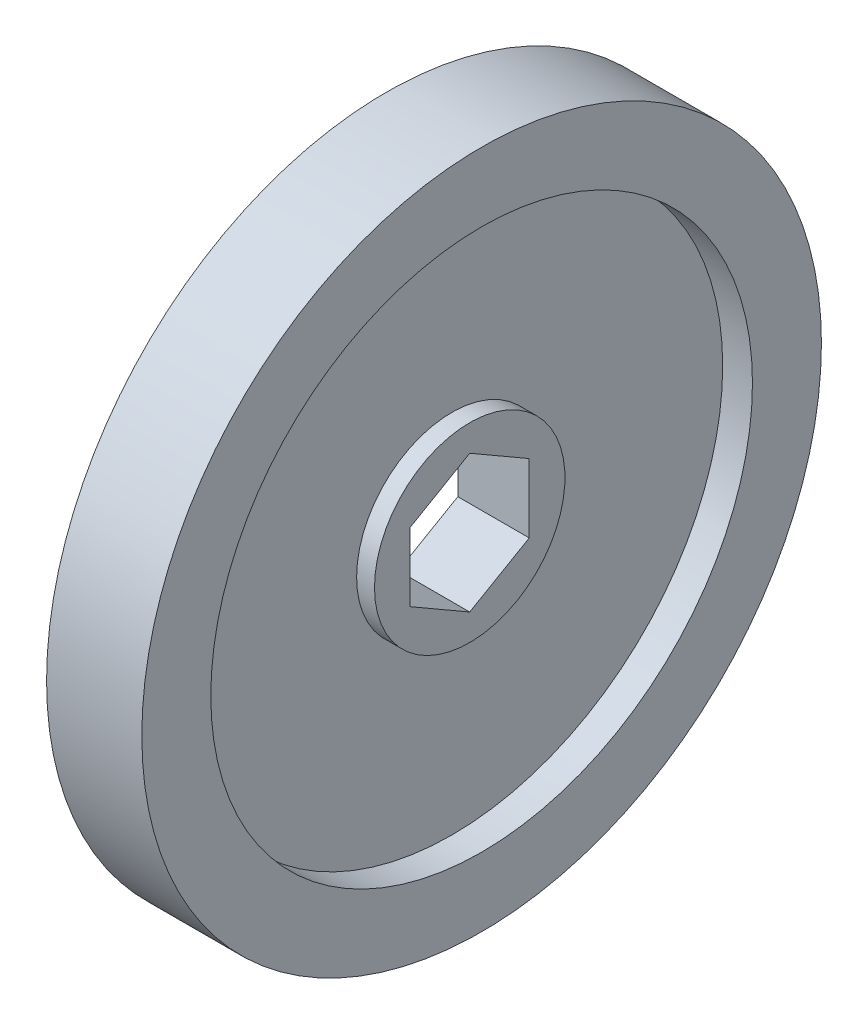
ISO-10303-21;
HEADER;
FILE_DESCRIPTION(('STEP AP214'),'2;1');
FILE_NAME('part.step','',(''),(''),'','','');
FILE_SCHEMA(('AUTOMOTIVE_DESIGN { 1 0 10303 214 1 1 1 1 }'));
ENDSEC;
DATA;
#1=APPLICATION_CONTEXT('core data for automotive mechanical design processes');
#2=APPLICATION_PROTOCOL_DEFINITION('international standard','automotive_design',2000,#1);
#3=PRODUCT_CONTEXT('',#1,'mechanical');
#4=PRODUCT('Part','Part','',(#3));
#5=PRODUCT_RELATED_PRODUCT_CATEGORY('part','',(#4));
#6=PRODUCT_DEFINITION_FORMATION('','',#4);
#7=PRODUCT_DEFINITION_CONTEXT('part definition',#1,'design');
#8=PRODUCT_DEFINITION('design','',#6,#7);
#9=PRODUCT_DEFINITION_SHAPE('','',#8);
#10=(LENGTH_UNIT() NAMED_UNIT(*) SI_UNIT(.MILLI.,.METRE.));
#11=(NAMED_UNIT(*) PLANE_ANGLE_UNIT() SI_UNIT($,.RADIAN.));
#12=(NAMED_UNIT(*) SI_UNIT($,.STERADIAN.) SOLID_ANGLE_UNIT());
#13=UNCERTAINTY_MEASURE_WITH_UNIT(LENGTH_MEASURE(1.E-05),#10,'distance_accuracy_value','');
#14=(GEOMETRIC_REPRESENTATION_CONTEXT(3) GLOBAL_UNCERTAINTY_ASSIGNED_CONTEXT((#13)) GLOBAL_UNIT_ASSIGNED_CONTEXT((#10,
#11,#12)) REPRESENTATION_CONTEXT('',''));
#15=CARTESIAN_POINT('',(0.,0.,0.));
#16=DIRECTION('',(0.,0.,1.));
#17=DIRECTION('',(1.,0.,0.));
#18=AXIS2_PLACEMENT_3D('',#15,#16,#17);
#19=CARTESIAN_POINT('',(5.08,36.25,0.));
#20=DIRECTION('',(-1.,0.,0.));
#21=DIRECTION('',(0.,0.,1.));
#22=AXIS2_PLACEMENT_3D('',#19,#20,#21);
#23=PLANE('',#22);
#24=CARTESIAN_POINT('',(5.08,0.,0.));
#25=DIRECTION('',(-1.,0.,0.));
#26=DIRECTION('',(0.,0.,1.));
#27=AXIS2_PLACEMENT_3D('',#24,#25,#26);
#28=CIRCLE('',#27,36.25);
#29=CARTESIAN_POINT('',(5.08,0.,36.25));
#30=VERTEX_POINT('',#29);
#31=EDGE_CURVE('E129',#30,#30,#28,.T.);
#32=ORIENTED_EDGE('',*,*,#31,.F.);
#33=EDGE_LOOP('',(#32));
#34=FACE_BOUND('',#33,.T.);
#35=CARTESIAN_POINT('',(5.08,0.,0.));
#36=DIRECTION('',(-1.,0.,0.));
#37=DIRECTION('',(0.,0.,1.));
#38=AXIS2_PLACEMENT_3D('',#35,#36,#37);
#39=CIRCLE('',#38,28.8925);
#40=CARTESIAN_POINT('',(5.08,0.,28.8925));
#41=VERTEX_POINT('',#40);
#42=EDGE_CURVE('E162',#41,#41,#39,.T.);
#43=ORIENTED_EDGE('',*,*,#42,.T.);
#44=EDGE_LOOP('',(#43));
#45=FACE_BOUND('',#44,.T.);
#46=ADVANCED_FACE('F44',(#34,#45),#23,.F.);
#47=CARTESIAN_POINT('',(-12.5660346603092,0.,0.));
#48=DIRECTION('',(-1.,0.,0.));
#49=DIRECTION('',(0.,0.,1.));
#50=AXIS2_PLACEMENT_3D('',#47,#48,#49);
#51=CYLINDRICAL_SURFACE('',#50,28.8925);
#52=ORIENTED_EDGE('',*,*,#42,.F.);
#53=EDGE_LOOP('',(#52));
#54=FACE_BOUND('',#53,.T.);
#55=CARTESIAN_POINT('',(1.905,0.,0.));
#56=DIRECTION('',(-1.,0.,0.));
#57=DIRECTION('',(0.,0.,1.));
#58=AXIS2_PLACEMENT_3D('',#55,#56,#57);
#59=CIRCLE('',#58,28.8925);
#60=CARTESIAN_POINT('',(1.905,0.,28.8925));
#61=VERTEX_POINT('',#60);
#62=EDGE_CURVE('E159',#61,#61,#59,.T.);
#63=ORIENTED_EDGE('',*,*,#62,.T.);
#64=EDGE_LOOP('',(#63));
#65=FACE_BOUND('',#64,.T.);
#66=ADVANCED_FACE('F201',(#54,#65),#51,.F.);
#67=CARTESIAN_POINT('',(1.905,28.8925,0.));
#68=DIRECTION('',(-1.,0.,0.));
#69=DIRECTION('',(0.,0.,1.));
#70=AXIS2_PLACEMENT_3D('',#67,#68,#69);
#71=PLANE('',#70);
#72=ORIENTED_EDGE('',*,*,#62,.F.);
#73=EDGE_LOOP('',(#72));
#74=FACE_BOUND('',#73,.T.);
#75=CARTESIAN_POINT('',(1.905,0.,0.));
#76=DIRECTION('',(-1.,0.,0.));
#77=DIRECTION('',(0.,0.,1.));
#78=AXIS2_PLACEMENT_3D('',#75,#76,#77);
#79=CIRCLE('',#78,10.16);
#80=CARTESIAN_POINT('',(1.905,0.,10.16));
#81=VERTEX_POINT('',#80);
#82=EDGE_CURVE('E156',#81,#81,#79,.T.);
#83=ORIENTED_EDGE('',*,*,#82,.T.);
#84=EDGE_LOOP('',(#83));
#85=FACE_BOUND('',#84,.T.);
#86=ADVANCED_FACE('F206',(#74,#85),#71,.F.);
#87=CARTESIAN_POINT('',(-12.5660346603092,0.,0.));
#88=DIRECTION('',(-1.,0.,0.));
#89=DIRECTION('',(0.,0.,1.));
#90=AXIS2_PLACEMENT_3D('',#87,#88,#89);
#91=CYLINDRICAL_SURFACE('',#90,10.16);
#92=ORIENTED_EDGE('',*,*,#82,.F.);
#93=EDGE_LOOP('',(#92));
#94=FACE_BOUND('',#93,.T.);
#95=CARTESIAN_POINT('',(3.81,0.,0.));
#96=DIRECTION('',(-1.,0.,0.));
#97=DIRECTION('',(0.,0.,1.));
#98=AXIS2_PLACEMENT_3D('',#95,#96,#97);
#99=CIRCLE('',#98,10.16);
#100=CARTESIAN_POINT('',(3.81,0.,10.16));
#101=VERTEX_POINT('',#100);
#102=EDGE_CURVE('E153',#101,#101,#99,.T.);
#103=ORIENTED_EDGE('',*,*,#102,.T.);
#104=EDGE_LOOP('',(#103));
#105=FACE_BOUND('',#104,.T.);
#106=ADVANCED_FACE('F216',(#94,#105),#91,.T.);
#107=CARTESIAN_POINT('',(3.81,10.16,0.));
#108=DIRECTION('',(-1.,0.,0.));
#109=DIRECTION('',(0.,0.,1.));
#110=AXIS2_PLACEMENT_3D('',#107,#108,#109);
#111=PLANE('',#110);
#112=DIRECTION('',(0.,-0.5,0.866025403784439));
#113=VECTOR('',#112,1.);
#114=CARTESIAN_POINT('',(3.81,7.33234841870825,0.));
#115=LINE('',#114,#113);
#116=CARTESIAN_POINT('',(3.81,7.33234841870825,0.));
#117=VERTEX_POINT('',#116);
#118=CARTESIAN_POINT('',(3.81,3.66617420935413,6.35));
#119=VERTEX_POINT('',#118);
#120=EDGE_CURVE('E108',#117,#119,#115,.T.);
#121=ORIENTED_EDGE('',*,*,#120,.F.);
#122=DIRECTION('',(0.,0.5,0.866025403784439));
#123=VECTOR('',#122,1.);
#124=CARTESIAN_POINT('',(3.81,3.66617420935412,-6.35));
#125=LINE('',#124,#123);
#126=CARTESIAN_POINT('',(3.81,3.66617420935412,-6.35));
#127=VERTEX_POINT('',#126);
#128=EDGE_CURVE('E58',#127,#117,#125,.T.);
#129=ORIENTED_EDGE('',*,*,#128,.F.);
#130=DIRECTION('',(0.,1.,0.));
#131=VECTOR('',#130,1.);
#132=CARTESIAN_POINT('',(3.81,-3.66617420935413,-6.35));
#133=LINE('',#132,#131);
#134=CARTESIAN_POINT('',(3.81,-3.66617420935413,-6.35));
#135=VERTEX_POINT('',#134);
#136=EDGE_CURVE('E124',#135,#127,#133,.T.);
#137=ORIENTED_EDGE('',*,*,#136,.F.);
#138=DIRECTION('',(0.,0.5,-0.866025403784439));
#139=VECTOR('',#138,1.);
#140=CARTESIAN_POINT('',(3.81,-7.33234841870825,0.));
#141=LINE('',#140,#139);
#142=CARTESIAN_POINT('',(3.81,-7.33234841870825,0.));
#143=VERTEX_POINT('',#142);
#144=EDGE_CURVE('E118',#143,#135,#141,.T.);
#145=ORIENTED_EDGE('',*,*,#144,.F.);
#146=DIRECTION('',(0.,-0.5,-0.866025403784439));
#147=VECTOR('',#146,1.);
#148=CARTESIAN_POINT('',(3.81,-3.66617420935413,6.35));
#149=LINE('',#148,#147);
#150=CARTESIAN_POINT('',(3.81,-3.66617420935413,6.35));
#151=VERTEX_POINT('',#150);
#152=EDGE_CURVE('E116',#151,#143,#149,.T.);
#153=ORIENTED_EDGE('',*,*,#152,.F.);
#154=DIRECTION('',(0.,-1.,0.));
#155=VECTOR('',#154,1.);
#156=CARTESIAN_POINT('',(3.81,3.66617420935413,6.35));
#157=LINE('',#156,#155);
#158=EDGE_CURVE('E99',#119,#151,#157,.T.);
#159=ORIENTED_EDGE('',*,*,#158,.F.);
#160=EDGE_LOOP('',(#121,#129,#137,#145,#153,#159));
#161=FACE_BOUND('',#160,.T.);
#162=ORIENTED_EDGE('',*,*,#102,.F.);
#163=EDGE_LOOP('',(#162));
#164=FACE_BOUND('',#163,.T.);
#165=ADVANCED_FACE('F112',(#161,#164),#111,.F.);
#166=CARTESIAN_POINT('',(-3.81,10.16,0.));
#167=DIRECTION('',(1.,0.,0.));
#168=DIRECTION('',(0.,0.,-1.));
#169=AXIS2_PLACEMENT_3D('',#166,#167,#168);
#170=PLANE('',#169);
#171=DIRECTION('',(0.,1.,0.));
#172=VECTOR('',#171,1.);
#173=CARTESIAN_POINT('',(-3.81,10.16,-6.35));
#174=LINE('',#173,#172);
#175=CARTESIAN_POINT('',(-3.81,-3.66617420935413,-6.35));
#176=VERTEX_POINT('',#175);
#177=CARTESIAN_POINT('',(-3.81,3.66617420935412,-6.35));
#178=VERTEX_POINT('',#177);
#179=EDGE_CURVE('E51',#176,#178,#174,.T.);
#180=ORIENTED_EDGE('',*,*,#179,.T.);
#181=DIRECTION('',(0.,0.5,0.866025403784439));
#182=VECTOR('',#181,1.);
#183=CARTESIAN_POINT('',(-3.81,8.03926131403118,1.22440905122495));
#184=LINE('',#183,#182);
#185=CARTESIAN_POINT('',(-3.81,7.33234841870825,0.));
#186=VERTEX_POINT('',#185);
#187=EDGE_CURVE('E13',#178,#186,#184,.T.);
#188=ORIENTED_EDGE('',*,*,#187,.T.);
#189=DIRECTION('',(0.,-0.5,0.866025403784439));
#190=VECTOR('',#189,1.);
#191=CARTESIAN_POINT('',(-3.81,8.03926131403118,-1.22440905122495));
#192=LINE('',#191,#190);
#193=CARTESIAN_POINT('',(-3.81,3.66617420935413,6.35));
#194=VERTEX_POINT('',#193);
#195=EDGE_CURVE('E165',#186,#194,#192,.T.);
#196=ORIENTED_EDGE('',*,*,#195,.T.);
#197=DIRECTION('',(0.,-1.,0.));
#198=VECTOR('',#197,1.);
#199=CARTESIAN_POINT('',(-3.81,10.16,6.35));
#200=LINE('',#199,#198);
#201=CARTESIAN_POINT('',(-3.81,-3.66617420935413,6.35));
#202=VERTEX_POINT('',#201);
#203=EDGE_CURVE('E102',#194,#202,#200,.T.);
#204=ORIENTED_EDGE('',*,*,#203,.T.);
#205=DIRECTION('',(0.,-0.5,-0.866025403784439));
#206=VECTOR('',#205,1.);
#207=CARTESIAN_POINT('',(-3.81,-2.95926131403119,7.57440905122495));
#208=LINE('',#207,#206);
#209=CARTESIAN_POINT('',(-3.81,-7.33234841870825,0.));
#210=VERTEX_POINT('',#209);
#211=EDGE_CURVE('E168',#202,#210,#208,.T.);
#212=ORIENTED_EDGE('',*,*,#211,.T.);
#213=DIRECTION('',(0.,0.5,-0.866025403784439));
#214=VECTOR('',#213,1.);
#215=CARTESIAN_POINT('',(-3.81,-2.95926131403119,-7.57440905122495));
#216=LINE('',#215,#214);
#217=EDGE_CURVE('E171',#210,#176,#216,.T.);
#218=ORIENTED_EDGE('',*,*,#217,.T.);
#219=EDGE_LOOP('',(#180,#188,#196,#204,#212,#218));
#220=FACE_BOUND('',#219,.T.);
#221=CARTESIAN_POINT('',(-3.81,0.,0.));
#222=DIRECTION('',(-1.,0.,0.));
#223=DIRECTION('',(0.,0.,1.));
#224=AXIS2_PLACEMENT_3D('',#221,#222,#223);
#225=CIRCLE('',#224,10.16);
#226=CARTESIAN_POINT('',(-3.81,0.,10.16));
#227=VERTEX_POINT('',#226);
#228=EDGE_CURVE('E150',#227,#227,#225,.T.);
#229=ORIENTED_EDGE('',*,*,#228,.T.);
#230=EDGE_LOOP('',(#229));
#231=FACE_BOUND('',#230,.T.);
#232=ADVANCED_FACE('F175',(#220,#231),#170,.F.);
#233=CARTESIAN_POINT('',(-12.5660346603092,0.,0.));
#234=DIRECTION('',(-1.,0.,0.));
#235=DIRECTION('',(0.,0.,1.));
#236=AXIS2_PLACEMENT_3D('',#233,#234,#235);
#237=CYLINDRICAL_SURFACE('',#236,10.16);
#238=ORIENTED_EDGE('',*,*,#228,.F.);
#239=EDGE_LOOP('',(#238));
#240=FACE_BOUND('',#239,.T.);
#241=CARTESIAN_POINT('',(-1.905,0.,0.));
#242=DIRECTION('',(-1.,0.,0.));
#243=DIRECTION('',(0.,0.,1.));
#244=AXIS2_PLACEMENT_3D('',#241,#242,#243);
#245=CIRCLE('',#244,10.16);
#246=CARTESIAN_POINT('',(-1.905,0.,10.16));
#247=VERTEX_POINT('',#246);
#248=EDGE_CURVE('E147',#247,#247,#245,.T.);
#249=ORIENTED_EDGE('',*,*,#248,.T.);
#250=EDGE_LOOP('',(#249));
#251=FACE_BOUND('',#250,.T.);
#252=ADVANCED_FACE('F229',(#240,#251),#237,.T.);
#253=CARTESIAN_POINT('',(-1.905,28.8925,0.));
#254=DIRECTION('',(1.,0.,0.));
#255=DIRECTION('',(0.,0.,-1.));
#256=AXIS2_PLACEMENT_3D('',#253,#254,#255);
#257=PLANE('',#256);
#258=ORIENTED_EDGE('',*,*,#248,.F.);
#259=EDGE_LOOP('',(#258));
#260=FACE_BOUND('',#259,.T.);
#261=CARTESIAN_POINT('',(-1.905,0.,0.));
#262=DIRECTION('',(-1.,0.,0.));
#263=DIRECTION('',(0.,0.,1.));
#264=AXIS2_PLACEMENT_3D('',#261,#262,#263);
#265=CIRCLE('',#264,28.8925);
#266=CARTESIAN_POINT('',(-1.905,0.,28.8925));
#267=VERTEX_POINT('',#266);
#268=EDGE_CURVE('E144',#267,#267,#265,.T.);
#269=ORIENTED_EDGE('',*,*,#268,.T.);
#270=EDGE_LOOP('',(#269));
#271=FACE_BOUND('',#270,.T.);
#272=ADVANCED_FACE('F234',(#260,#271),#257,.F.);
#273=CARTESIAN_POINT('',(-12.5660346603092,0.,0.));
#274=DIRECTION('',(-1.,0.,0.));
#275=DIRECTION('',(0.,0.,1.));
#276=AXIS2_PLACEMENT_3D('',#273,#274,#275);
#277=CYLINDRICAL_SURFACE('',#276,28.8925);
#278=ORIENTED_EDGE('',*,*,#268,.F.);
#279=EDGE_LOOP('',(#278));
#280=FACE_BOUND('',#279,.T.);
#281=CARTESIAN_POINT('',(-5.08,0.,0.));
#282=DIRECTION('',(-1.,0.,0.));
#283=DIRECTION('',(0.,0.,1.));
#284=AXIS2_PLACEMENT_3D('',#281,#282,#283);
#285=CIRCLE('',#284,28.8925);
#286=CARTESIAN_POINT('',(-5.08,0.,28.8925));
#287=VERTEX_POINT('',#286);
#288=EDGE_CURVE('E141',#287,#287,#285,.T.);
#289=ORIENTED_EDGE('',*,*,#288,.T.);
#290=EDGE_LOOP('',(#289));
#291=FACE_BOUND('',#290,.T.);
#292=ADVANCED_FACE('F238',(#280,#291),#277,.F.);
#293=CARTESIAN_POINT('',(-5.08,36.25,0.));
#294=DIRECTION('',(1.,0.,0.));
#295=DIRECTION('',(0.,0.,-1.));
#296=AXIS2_PLACEMENT_3D('',#293,#294,#295);
#297=PLANE('',#296);
#298=ORIENTED_EDGE('',*,*,#288,.F.);
#299=EDGE_LOOP('',(#298));
#300=FACE_BOUND('',#299,.T.);
#301=CARTESIAN_POINT('',(-5.08,0.,0.));
#302=DIRECTION('',(-1.,0.,0.));
#303=DIRECTION('',(0.,0.,1.));
#304=AXIS2_PLACEMENT_3D('',#301,#302,#303);
#305=CIRCLE('',#304,36.25);
#306=CARTESIAN_POINT('',(-5.08,0.,36.25));
#307=VERTEX_POINT('',#306);
#308=EDGE_CURVE('E138',#307,#307,#305,.T.);
#309=ORIENTED_EDGE('',*,*,#308,.T.);
#310=EDGE_LOOP('',(#309));
#311=FACE_BOUND('',#310,.T.);
#312=ADVANCED_FACE('F196',(#300,#311),#297,.F.);
#313=CARTESIAN_POINT('',(-12.5660346603092,0.,0.));
#314=DIRECTION('',(-1.,0.,0.));
#315=DIRECTION('',(0.,0.,1.));
#316=AXIS2_PLACEMENT_3D('',#313,#314,#315);
#317=CYLINDRICAL_SURFACE('',#316,36.25);
#318=ORIENTED_EDGE('',*,*,#308,.F.);
#319=EDGE_LOOP('',(#318));
#320=FACE_BOUND('',#319,.T.);
#321=ORIENTED_EDGE('',*,*,#31,.T.);
#322=EDGE_LOOP('',(#321));
#323=FACE_BOUND('',#322,.T.);
#324=ADVANCED_FACE('F189',(#320,#323),#317,.T.);
#325=CARTESIAN_POINT('',(-5.08,3.66617420935412,-6.35));
#326=DIRECTION('',(0.,0.866025403784439,-0.5));
#327=DIRECTION('',(0.,0.5,0.866025403784439));
#328=AXIS2_PLACEMENT_3D('',#325,#326,#327);
#329=PLANE('',#328);
#330=DIRECTION('',(1.,0.,0.));
#331=VECTOR('',#330,1.);
#332=CARTESIAN_POINT('',(-5.08,3.66617420935412,-6.35));
#333=LINE('',#332,#331);
#334=EDGE_CURVE('E127',#178,#127,#333,.T.);
#335=ORIENTED_EDGE('',*,*,#334,.T.);
#336=ORIENTED_EDGE('',*,*,#128,.T.);
#337=DIRECTION('',(1.,0.,0.));
#338=VECTOR('',#337,1.);
#339=CARTESIAN_POINT('',(-5.08,7.33234841870825,0.));
#340=LINE('',#339,#338);
#341=EDGE_CURVE('E105',#186,#117,#340,.T.);
#342=ORIENTED_EDGE('',*,*,#341,.F.);
#343=ORIENTED_EDGE('',*,*,#187,.F.);
#344=EDGE_LOOP('',(#335,#336,#342,#343));
#345=FACE_BOUND('',#344,.T.);
#346=ADVANCED_FACE('F187',(#345),#329,.F.);
#347=CARTESIAN_POINT('',(-5.08,-3.66617420935413,-6.35));
#348=DIRECTION('',(0.,0.,-1.));
#349=DIRECTION('',(0.,1.,0.));
#350=AXIS2_PLACEMENT_3D('',#347,#348,#349);
#351=PLANE('',#350);
#352=DIRECTION('',(1.,0.,0.));
#353=VECTOR('',#352,1.);
#354=CARTESIAN_POINT('',(-5.08,-3.66617420935413,-6.35));
#355=LINE('',#354,#353);
#356=EDGE_CURVE('E130',#176,#135,#355,.T.);
#357=ORIENTED_EDGE('',*,*,#356,.T.);
#358=ORIENTED_EDGE('',*,*,#136,.T.);
#359=ORIENTED_EDGE('',*,*,#334,.F.);
#360=ORIENTED_EDGE('',*,*,#179,.F.);
#361=EDGE_LOOP('',(#357,#358,#359,#360));
#362=FACE_BOUND('',#361,.T.);
#363=ADVANCED_FACE('F180',(#362),#351,.F.);
#364=CARTESIAN_POINT('',(-5.08,-7.33234841870825,0.));
#365=DIRECTION('',(0.,-0.866025403784439,-0.5));
#366=DIRECTION('',(0.,0.5,-0.866025403784439));
#367=AXIS2_PLACEMENT_3D('',#364,#365,#366);
#368=PLANE('',#367);
#369=DIRECTION('',(1.,0.,0.));
#370=VECTOR('',#369,1.);
#371=CARTESIAN_POINT('',(-5.08,-7.33234841870825,0.));
#372=LINE('',#371,#370);
#373=EDGE_CURVE('E132',#210,#143,#372,.T.);
#374=ORIENTED_EDGE('',*,*,#373,.T.);
#375=ORIENTED_EDGE('',*,*,#144,.T.);
#376=ORIENTED_EDGE('',*,*,#356,.F.);
#377=ORIENTED_EDGE('',*,*,#217,.F.);
#378=EDGE_LOOP('',(#374,#375,#376,#377));
#379=FACE_BOUND('',#378,.T.);
#380=ADVANCED_FACE('F182',(#379),#368,.F.);
#381=CARTESIAN_POINT('',(-5.08,-3.66617420935413,6.35));
#382=DIRECTION('',(0.,-0.866025403784439,0.5));
#383=DIRECTION('',(0.,-0.5,-0.866025403784439));
#384=AXIS2_PLACEMENT_3D('',#381,#382,#383);
#385=PLANE('',#384);
#386=DIRECTION('',(1.,0.,0.));
#387=VECTOR('',#386,1.);
#388=CARTESIAN_POINT('',(-5.08,-3.66617420935413,6.35));
#389=LINE('',#388,#387);
#390=EDGE_CURVE('E104',#202,#151,#389,.T.);
#391=ORIENTED_EDGE('',*,*,#390,.T.);
#392=ORIENTED_EDGE('',*,*,#152,.T.);
#393=ORIENTED_EDGE('',*,*,#373,.F.);
#394=ORIENTED_EDGE('',*,*,#211,.F.);
#395=EDGE_LOOP('',(#391,#392,#393,#394));
#396=FACE_BOUND('',#395,.T.);
#397=ADVANCED_FACE('F186',(#396),#385,.F.);
#398=CARTESIAN_POINT('',(-5.08,3.66617420935413,6.35));
#399=DIRECTION('',(0.,0.,1.));
#400=DIRECTION('',(0.,-1.,0.));
#401=AXIS2_PLACEMENT_3D('',#398,#399,#400);
#402=PLANE('',#401);
#403=DIRECTION('',(1.,0.,0.));
#404=VECTOR('',#403,1.);
#405=CARTESIAN_POINT('',(-5.08,3.66617420935413,6.35));
#406=LINE('',#405,#404);
#407=EDGE_CURVE('E66',#194,#119,#406,.T.);
#408=ORIENTED_EDGE('',*,*,#407,.T.);
#409=ORIENTED_EDGE('',*,*,#158,.T.);
#410=ORIENTED_EDGE('',*,*,#390,.F.);
#411=ORIENTED_EDGE('',*,*,#203,.F.);
#412=EDGE_LOOP('',(#408,#409,#410,#411));
#413=FACE_BOUND('',#412,.T.);
#414=ADVANCED_FACE('F96',(#413),#402,.F.);
#415=CARTESIAN_POINT('',(-5.08,7.33234841870825,0.));
#416=DIRECTION('',(0.,0.866025403784439,0.5));
#417=DIRECTION('',(0.,-0.5,0.866025403784439));
#418=AXIS2_PLACEMENT_3D('',#415,#416,#417);
#419=PLANE('',#418);
#420=ORIENTED_EDGE('',*,*,#341,.T.);
#421=ORIENTED_EDGE('',*,*,#120,.T.);
#422=ORIENTED_EDGE('',*,*,#407,.F.);
#423=ORIENTED_EDGE('',*,*,#195,.F.);
#424=EDGE_LOOP('',(#420,#421,#422,#423));
#425=FACE_BOUND('',#424,.T.);
#426=ADVANCED_FACE('F109',(#425),#419,.F.);
#427=CLOSED_SHELL('',(#46,#66,#86,#106,#165,#232,#252,#272,#292,#312,#324,#346,#363,#380,#397,
#414,#426));
#428=MANIFOLD_SOLID_BREP('B2',#427);
#429=ADVANCED_BREP_SHAPE_REPRESENTATION('',(#18,#428),#14);
#430=SHAPE_DEFINITION_REPRESENTATION(#9,#429);
ENDSEC;
END-ISO-10303-21;
